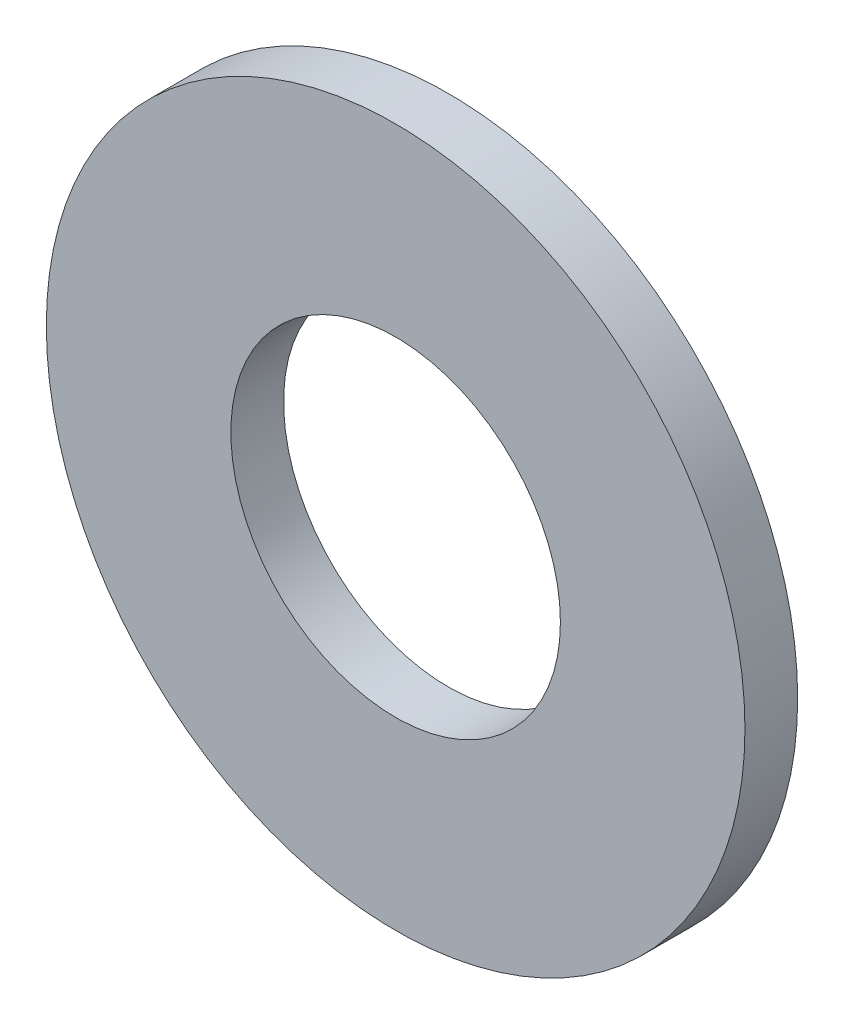
ISO-10303-21;
HEADER;
FILE_DESCRIPTION(('STEP AP214'),'2;1');
FILE_NAME('part.step','',(''),(''),'','','');
FILE_SCHEMA(('AUTOMOTIVE_DESIGN { 1 0 10303 214 1 1 1 1 }'));
ENDSEC;
DATA;
#1=APPLICATION_CONTEXT('core data for automotive mechanical design processes');
#2=APPLICATION_PROTOCOL_DEFINITION('international standard','automotive_design',2000,#1);
#3=PRODUCT_CONTEXT('',#1,'mechanical');
#4=PRODUCT('Part','Part','',(#3));
#5=PRODUCT_RELATED_PRODUCT_CATEGORY('part','',(#4));
#6=PRODUCT_DEFINITION_FORMATION('','',#4);
#7=PRODUCT_DEFINITION_CONTEXT('part definition',#1,'design');
#8=PRODUCT_DEFINITION('design','',#6,#7);
#9=PRODUCT_DEFINITION_SHAPE('','',#8);
#10=(LENGTH_UNIT() NAMED_UNIT(*) SI_UNIT(.MILLI.,.METRE.));
#11=(NAMED_UNIT(*) PLANE_ANGLE_UNIT() SI_UNIT($,.RADIAN.));
#12=(NAMED_UNIT(*) SI_UNIT($,.STERADIAN.) SOLID_ANGLE_UNIT());
#13=UNCERTAINTY_MEASURE_WITH_UNIT(LENGTH_MEASURE(1.E-05),#10,'distance_accuracy_value','');
#14=(GEOMETRIC_REPRESENTATION_CONTEXT(3) GLOBAL_UNCERTAINTY_ASSIGNED_CONTEXT((#13)) GLOBAL_UNIT_ASSIGNED_CONTEXT((#10,
#11,#12)) REPRESENTATION_CONTEXT('',''));
#15=CARTESIAN_POINT('',(0.,0.,0.));
#16=DIRECTION('',(0.,0.,1.));
#17=DIRECTION('',(1.,0.,0.));
#18=AXIS2_PLACEMENT_3D('',#15,#16,#17);
#19=CARTESIAN_POINT('',(0.,0.,1.));
#20=DIRECTION('',(0.,0.,1.));
#21=DIRECTION('',(1.,0.,0.));
#22=AXIS2_PLACEMENT_3D('',#19,#20,#21);
#23=PLANE('',#22);
#24=CARTESIAN_POINT('',(0.,0.,1.));
#25=DIRECTION('',(0.,0.,1.));
#26=DIRECTION('',(1.,0.,0.));
#27=AXIS2_PLACEMENT_3D('',#24,#25,#26);
#28=CIRCLE('',#27,13.25);
#29=CARTESIAN_POINT('',(13.25,0.,1.));
#30=VERTEX_POINT('',#29);
#31=EDGE_CURVE('E10',#30,#30,#28,.T.);
#32=ORIENTED_EDGE('',*,*,#31,.T.);
#33=EDGE_LOOP('',(#32));
#34=FACE_BOUND('',#33,.T.);
#35=CARTESIAN_POINT('',(0.,0.,1.));
#36=DIRECTION('',(0.,0.,1.));
#37=DIRECTION('',(1.,0.,0.));
#38=AXIS2_PLACEMENT_3D('',#35,#36,#37);
#39=CIRCLE('',#38,6.25);
#40=CARTESIAN_POINT('',(6.25,0.,1.));
#41=VERTEX_POINT('',#40);
#42=EDGE_CURVE('E48',#41,#41,#39,.T.);
#43=ORIENTED_EDGE('',*,*,#42,.F.);
#44=EDGE_LOOP('',(#43));
#45=FACE_BOUND('',#44,.T.);
#46=ADVANCED_FACE('F37',(#34,#45),#23,.T.);
#47=CARTESIAN_POINT('',(0.,0.,-1.));
#48=DIRECTION('',(0.,0.,1.));
#49=DIRECTION('',(1.,0.,0.));
#50=AXIS2_PLACEMENT_3D('',#47,#48,#49);
#51=PLANE('',#50);
#52=CARTESIAN_POINT('',(0.,0.,-1.));
#53=DIRECTION('',(0.,0.,1.));
#54=DIRECTION('',(1.,0.,0.));
#55=AXIS2_PLACEMENT_3D('',#52,#53,#54);
#56=CIRCLE('',#55,13.25);
#57=CARTESIAN_POINT('',(13.25,0.,-1.));
#58=VERTEX_POINT('',#57);
#59=EDGE_CURVE('E41',#58,#58,#56,.T.);
#60=ORIENTED_EDGE('',*,*,#59,.F.);
#61=EDGE_LOOP('',(#60));
#62=FACE_BOUND('',#61,.T.);
#63=CARTESIAN_POINT('',(0.,0.,-1.));
#64=DIRECTION('',(0.,0.,1.));
#65=DIRECTION('',(1.,0.,0.));
#66=AXIS2_PLACEMENT_3D('',#63,#64,#65);
#67=CIRCLE('',#66,6.25);
#68=CARTESIAN_POINT('',(6.25,0.,-1.));
#69=VERTEX_POINT('',#68);
#70=EDGE_CURVE('E50',#69,#69,#67,.T.);
#71=ORIENTED_EDGE('',*,*,#70,.T.);
#72=EDGE_LOOP('',(#71));
#73=FACE_BOUND('',#72,.T.);
#74=ADVANCED_FACE('F60',(#62,#73),#51,.F.);
#75=CARTESIAN_POINT('',(0.,0.,1.));
#76=DIRECTION('',(0.,0.,-1.));
#77=DIRECTION('',(-1.,0.,0.));
#78=AXIS2_PLACEMENT_3D('',#75,#76,#77);
#79=CYLINDRICAL_SURFACE('',#78,13.25);
#80=ORIENTED_EDGE('',*,*,#31,.F.);
#81=EDGE_LOOP('',(#80));
#82=FACE_BOUND('',#81,.T.);
#83=ORIENTED_EDGE('',*,*,#59,.T.);
#84=EDGE_LOOP('',(#83));
#85=FACE_BOUND('',#84,.T.);
#86=ADVANCED_FACE('F39',(#82,#85),#79,.T.);
#87=CARTESIAN_POINT('',(0.,0.,1.));
#88=DIRECTION('',(0.,0.,-1.));
#89=DIRECTION('',(-1.,0.,0.));
#90=AXIS2_PLACEMENT_3D('',#87,#88,#89);
#91=CYLINDRICAL_SURFACE('',#90,6.25);
#92=ORIENTED_EDGE('',*,*,#42,.T.);
#93=EDGE_LOOP('',(#92));
#94=FACE_BOUND('',#93,.T.);
#95=ORIENTED_EDGE('',*,*,#70,.F.);
#96=EDGE_LOOP('',(#95));
#97=FACE_BOUND('',#96,.T.);
#98=ADVANCED_FACE('F56',(#94,#97),#91,.F.);
#99=CLOSED_SHELL('',(#46,#74,#86,#98));
#100=MANIFOLD_SOLID_BREP('B2',#99);
#101=ADVANCED_BREP_SHAPE_REPRESENTATION('',(#18,#100),#14);
#102=SHAPE_DEFINITION_REPRESENTATION(#9,#101);
ENDSEC;
END-ISO-10303-21;
